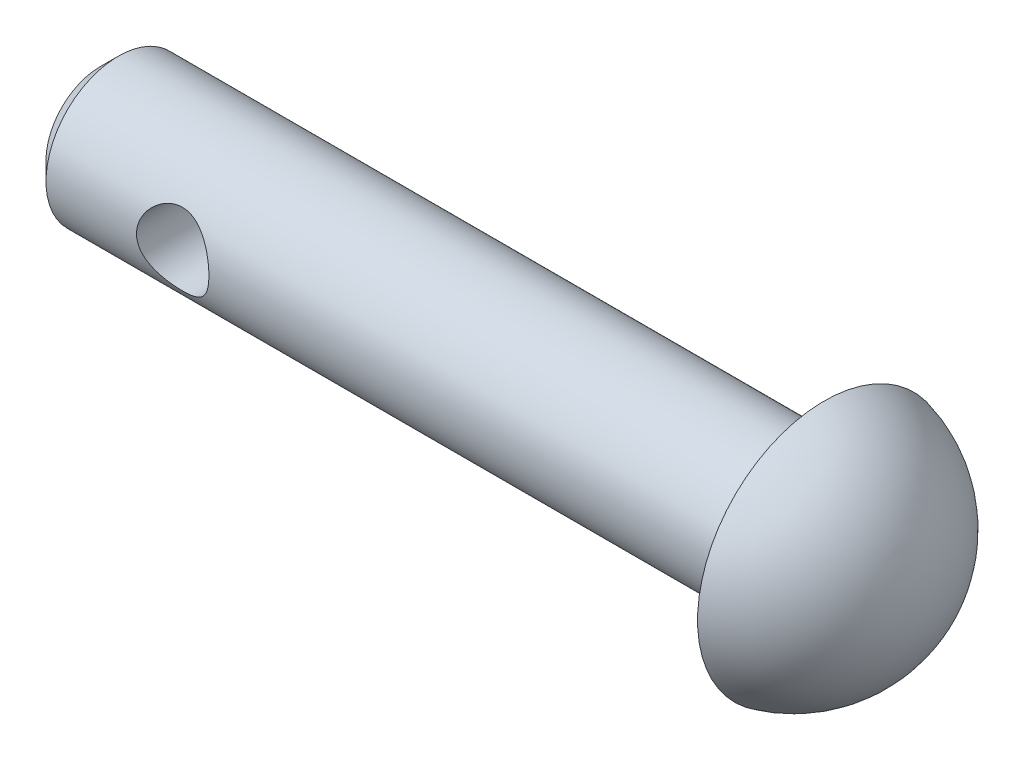
ISO-10303-21;
HEADER;
FILE_DESCRIPTION(('STEP AP214'),'2;1');
FILE_NAME('part.step','',(''),(''),'','','');
FILE_SCHEMA(('AUTOMOTIVE_DESIGN { 1 0 10303 214 1 1 1 1 }'));
ENDSEC;
DATA;
#1=APPLICATION_CONTEXT('core data for automotive mechanical design processes');
#2=APPLICATION_PROTOCOL_DEFINITION('international standard','automotive_design',2000,#1);
#3=PRODUCT_CONTEXT('',#1,'mechanical');
#4=PRODUCT('Part','Part','',(#3));
#5=PRODUCT_RELATED_PRODUCT_CATEGORY('part','',(#4));
#6=PRODUCT_DEFINITION_FORMATION('','',#4);
#7=PRODUCT_DEFINITION_CONTEXT('part definition',#1,'design');
#8=PRODUCT_DEFINITION('design','',#6,#7);
#9=PRODUCT_DEFINITION_SHAPE('','',#8);
#10=(LENGTH_UNIT() NAMED_UNIT(*) SI_UNIT(.MILLI.,.METRE.));
#11=(NAMED_UNIT(*) PLANE_ANGLE_UNIT() SI_UNIT($,.RADIAN.));
#12=(NAMED_UNIT(*) SI_UNIT($,.STERADIAN.) SOLID_ANGLE_UNIT());
#13=UNCERTAINTY_MEASURE_WITH_UNIT(LENGTH_MEASURE(1.E-05),#10,'distance_accuracy_value','');
#14=(GEOMETRIC_REPRESENTATION_CONTEXT(3) GLOBAL_UNCERTAINTY_ASSIGNED_CONTEXT((#13)) GLOBAL_UNIT_ASSIGNED_CONTEXT((#10,
#11,#12)) REPRESENTATION_CONTEXT('',''));
#15=CARTESIAN_POINT('',(0.,0.,0.));
#16=DIRECTION('',(0.,0.,1.));
#17=DIRECTION('',(1.,0.,0.));
#18=AXIS2_PLACEMENT_3D('',#15,#16,#17);
#19=CARTESIAN_POINT('',(-20.,0.,0.));
#20=DIRECTION('',(1.,0.,0.));
#21=DIRECTION('',(0.,0.,-1.));
#22=AXIS2_PLACEMENT_3D('',#19,#20,#21);
#23=CYLINDRICAL_SURFACE('',#22,2.);
#24=CARTESIAN_POINT('',(-19.5,0.,0.));
#25=DIRECTION('',(1.,0.,0.));
#26=DIRECTION('',(0.,0.,-1.));
#27=AXIS2_PLACEMENT_3D('',#24,#25,#26);
#28=CIRCLE('',#27,2.);
#29=CARTESIAN_POINT('',(-19.5,0.,-2.));
#30=VERTEX_POINT('',#29);
#31=EDGE_CURVE('E41',#30,#30,#28,.T.);
#32=ORIENTED_EDGE('',*,*,#31,.T.);
#33=EDGE_LOOP('',(#32));
#34=FACE_BOUND('',#33,.T.);
#35=CARTESIAN_POINT('',(-15.,0.,-2.));
#36=CARTESIAN_POINT('',(-15.0000033023195,-0.0525719629529865,-1.99999713404151));
#37=CARTESIAN_POINT('',(-15.0041700731217,-0.105206599698033,-1.99790491019518));
#38=CARTESIAN_POINT('',(-15.0206528803409,-0.208920235268425,-1.98974156037396));
#39=CARTESIAN_POINT('',(-15.0329843929976,-0.259996086713504,-1.98366287828984));
#40=CARTESIAN_POINT('',(-15.0651938086168,-0.358933544880575,-1.96816279403312));
#41=CARTESIAN_POINT('',(-15.085042384248,-0.406806802939181,-1.9587543917752));
#42=CARTESIAN_POINT('',(-15.1315706213649,-0.498472616806566,-1.93745776515779));
#43=CARTESIAN_POINT('',(-15.1582497442489,-0.54226549399005,-1.9255697363353));
#44=CARTESIAN_POINT('',(-15.2195172494853,-0.62750781776192,-1.89956258258057));
#45=CARTESIAN_POINT('',(-15.2544864792396,-0.668655211122113,-1.88535199127536));
#46=CARTESIAN_POINT('',(-15.330521479247,-0.744779444866978,-1.85659970246744));
#47=CARTESIAN_POINT('',(-15.3715918517724,-0.779751583106767,-1.84205776209035));
#48=CARTESIAN_POINT('',(-15.4624833495234,-0.84525200045028,-1.81298951197347));
#49=CARTESIAN_POINT('',(-15.5127360983459,-0.875225335551638,-1.79855186970132));
#50=CARTESIAN_POINT('',(-15.6183673359862,-0.926168226890696,-1.77285978772321));
#51=CARTESIAN_POINT('',(-15.6737421287227,-0.947144214966335,-1.7616030760699));
#52=CARTESIAN_POINT('',(-15.7846651054219,-0.97813244218859,-1.74457867037808));
#53=CARTESIAN_POINT('',(-15.8400044520674,-0.988725857080443,-1.73852271583713));
#54=CARTESIAN_POINT('',(-15.9519788377795,-1.00042699330885,-1.73181889948528));
#55=CARTESIAN_POINT('',(-16.0086125408712,-1.00154408837308,-1.73116569343288));
#56=CARTESIAN_POINT('',(-16.1142860243154,-0.994687287172296,-1.73510930257248));
#57=CARTESIAN_POINT('',(-16.163424031223,-0.987784559536823,-1.73908763662013));
#58=CARTESIAN_POINT('',(-16.259721909373,-0.966939849056935,-1.7507622873385));
#59=CARTESIAN_POINT('',(-16.3068811453053,-0.952995623897654,-1.75845978831776));
#60=CARTESIAN_POINT('',(-16.3992291325657,-0.918209780386006,-1.77687476412741));
#61=CARTESIAN_POINT('',(-16.4443463987858,-0.897215067115997,-1.78765840663998));
#62=CARTESIAN_POINT('',(-16.53063429259,-0.849041687668004,-1.81103404281404));
#63=CARTESIAN_POINT('',(-16.5718031356001,-0.821860243812469,-1.8236268478019));
#64=CARTESIAN_POINT('',(-16.6545212527432,-0.75806605491279,-1.85113157903286));
#65=CARTESIAN_POINT('',(-16.6954568735762,-0.720694458369283,-1.86613510236746));
#66=CARTESIAN_POINT('',(-16.7707354185909,-0.639555578741374,-1.89547623300407));
#67=CARTESIAN_POINT('',(-16.8050751920339,-0.595785256574287,-1.90981351958801));
#68=CARTESIAN_POINT('',(-16.8676856610297,-0.50051650583185,-1.93701987282964));
#69=CARTESIAN_POINT('',(-16.8956004724457,-0.448753591599411,-1.94978984162007));
#70=CARTESIAN_POINT('',(-16.942097029043,-0.340466215488799,-1.97157881121242));
#71=CARTESIAN_POINT('',(-16.9606861850152,-0.283945576265279,-1.98060078943553));
#72=CARTESIAN_POINT('',(-16.9864754037167,-0.172766491660705,-1.99324333741436));
#73=CARTESIAN_POINT('',(-16.9944912357468,-0.118341530548327,-1.99724938301312));
#74=CARTESIAN_POINT('',(-17.0014647311345,-0.00877959994935651,-2.00073013459102));
#75=CARTESIAN_POINT('',(-17.0004266856395,0.0463570198698988,-2.00020698721312));
#76=CARTESIAN_POINT('',(-16.9897933115812,0.151232971985991,-1.99491192253441));
#77=CARTESIAN_POINT('',(-16.98086746727,0.201059408049952,-1.9904724568819));
#78=CARTESIAN_POINT('',(-16.9557619281049,0.298406892301915,-1.97822171314819));
#79=CARTESIAN_POINT('',(-16.9395814335466,0.345927685690995,-1.97041006334332));
#80=CARTESIAN_POINT('',(-16.9000015335668,0.438888608449664,-1.95184251413669));
#81=CARTESIAN_POINT('',(-16.8764089498832,0.484230397006153,-1.94100881769939));
#82=CARTESIAN_POINT('',(-16.822892464354,0.570461361698921,-1.91743974317109));
#83=CARTESIAN_POINT('',(-16.7929658654066,0.611348629775281,-1.90470355565785));
#84=CARTESIAN_POINT('',(-16.7242395746671,0.691767689290653,-1.87708221337464));
#85=CARTESIAN_POINT('',(-16.6848571315464,0.730772077824639,-1.86210884848441));
#86=CARTESIAN_POINT('',(-16.6000748487307,0.80185632111324,-1.83262391603874));
#87=CARTESIAN_POINT('',(-16.5546708811836,0.833931385690841,-1.81811267381526));
#88=CARTESIAN_POINT('',(-16.4563563457997,0.891707914497694,-1.79051192226068));
#89=CARTESIAN_POINT('',(-16.4031887337914,0.917025495878636,-1.77752529663472));
#90=CARTESIAN_POINT('',(-16.2924899323075,0.958082826013803,-1.75574072368126));
#91=CARTESIAN_POINT('',(-16.2349644734988,0.97383491588757,-1.74693738240618));
#92=CARTESIAN_POINT('',(-16.1230897771386,0.99386168744968,-1.73561501008667));
#93=CARTESIAN_POINT('',(-16.068965746571,0.999092996400866,-1.73257383460491));
#94=CARTESIAN_POINT('',(-15.9605529328293,1.00068915438079,-1.73165354646175));
#95=CARTESIAN_POINT('',(-15.9062642312606,0.997057846624401,-1.73377219627552));
#96=CARTESIAN_POINT('',(-15.804516498468,0.981926125592265,-1.74237862050025));
#97=CARTESIAN_POINT('',(-15.7568995298556,0.971208314342801,-1.74843094482394));
#98=CARTESIAN_POINT('',(-15.6641918805753,0.943175358224647,-1.76371016187917));
#99=CARTESIAN_POINT('',(-15.619102017908,0.925858091159812,-1.77293807569675));
#100=CARTESIAN_POINT('',(-15.5293751490134,0.883815745300685,-1.79428530364528));
#101=CARTESIAN_POINT('',(-15.4849720981703,0.85867113781646,-1.8065572239619));
#102=CARTESIAN_POINT('',(-15.4007254638194,0.802150971636636,-1.8323533163459));
#103=CARTESIAN_POINT('',(-15.3608842694815,0.77077217123865,-1.84587813794522));
#104=CARTESIAN_POINT('',(-15.2818580176424,0.698203326664643,-1.87462323159313));
#105=CARTESIAN_POINT('',(-15.2433408976381,0.656284423010173,-1.88984983311469));
#106=CARTESIAN_POINT('',(-15.1737370165764,0.566154806220281,-1.91877752255088));
#107=CARTESIAN_POINT('',(-15.1426542605737,0.517940723256786,-1.9324777860804));
#108=CARTESIAN_POINT('',(-15.0887636372378,0.415931596819949,-1.95698009585103));
#109=CARTESIAN_POINT('',(-15.0660158305886,0.362099503934616,-1.96776096562909));
#110=CARTESIAN_POINT('',(-15.030191832081,0.250742101294193,-1.98501341363465));
#111=CARTESIAN_POINT('',(-15.0170881531704,0.193227799623168,-1.99149723372932));
#112=CARTESIAN_POINT('',(-15.0061025889241,0.112601946483386,-1.99695461909663));
#113=CARTESIAN_POINT('',(-15.0038173591364,0.0901618794395003,-1.99809365339202));
#114=CARTESIAN_POINT('',(-15.0007653344832,0.0451517318071585,-1.99961696977865));
#115=CARTESIAN_POINT('',(-14.9999985815288,0.0225816476473818,-2.00000123103763));
#116=CARTESIAN_POINT('',(-15.,0.,-2.));
#117=B_SPLINE_CURVE_WITH_KNOTS('',3,(#35,#36,#37,#38,#39,#40,#41,#42,#43,#44,#45,#46,#47,#48,
#49,#50,#51,#52,#53,#54,#55,#56,#57,#58,#59,#60,#61,#62,#63,#64,#65,#66,#67,#68,#69,#70,#71,#72,
#73,#74,#75,#76,#77,#78,#79,#80,#81,#82,#83,#84,#85,#86,#87,#88,#89,#90,#91,#92,#93,#94,#95,#96,
#97,#98,#99,#100,#101,#102,#103,#104,#105,#106,#107,#108,#109,#110,#111,#112,#113,#114,#115,
#116),.UNSPECIFIED.,.T.,.F.,(4,2,2,2,2,2,2,2,2,2,2,2,2,2,2,2,2,2,2,2,2,2,2,2,2,2,2,2,2,2,2,2,2,
2,2,2,2,2,2,2,4),(0.,0.157624257420293,0.315548149709198,0.472862155492299,0.630163760581568,
0.79698175871809,0.963926237654036,1.14381726430753,1.32357947898281,1.4925801214023,
1.6614135732902,1.8100571240932,1.95874803925678,2.11090240168487,2.26312521260222,
2.43464941333879,2.60625534598687,2.78583022214441,2.9652621691228,3.12983290471346,
3.29432564511476,3.44606906506122,3.59782921630932,3.75392856027899,3.9100945074834,
4.08159610644419,4.25321588615432,4.43314682159674,4.61284511940778,4.77529307498374,
4.93767059860006,5.08457930244183,5.23153528783678,5.38836456775615,5.54527561138958,
5.72125242752499,5.89732383376573,6.07464013662926,6.25144908624931,6.31915280137698,
6.38685838514848),.UNSPECIFIED.);
#118=CARTESIAN_POINT('',(-15.,0.,-2.));
#119=VERTEX_POINT('',#118);
#120=EDGE_CURVE('E45',#119,#119,#117,.T.);
#121=ORIENTED_EDGE('',*,*,#120,.F.);
#122=EDGE_LOOP('',(#121));
#123=FACE_BOUND('',#122,.T.);
#124=CARTESIAN_POINT('',(-15.,0.,2.));
#125=CARTESIAN_POINT('',(-15.0000033023195,0.0525719629529865,1.99999713404151));
#126=CARTESIAN_POINT('',(-15.0041700731217,0.105206599698033,1.99790491019518));
#127=CARTESIAN_POINT('',(-15.0206528803409,0.208920235268425,1.98974156037396));
#128=CARTESIAN_POINT('',(-15.0329843929976,0.259996086713504,1.98366287828984));
#129=CARTESIAN_POINT('',(-15.0651938086168,0.358933544880575,1.96816279403312));
#130=CARTESIAN_POINT('',(-15.085042384248,0.406806802939181,1.9587543917752));
#131=CARTESIAN_POINT('',(-15.1315706213649,0.498472616806566,1.93745776515779));
#132=CARTESIAN_POINT('',(-15.1582497442489,0.54226549399005,1.9255697363353));
#133=CARTESIAN_POINT('',(-15.2195172494853,0.62750781776192,1.89956258258057));
#134=CARTESIAN_POINT('',(-15.2544864792396,0.668655211122113,1.88535199127536));
#135=CARTESIAN_POINT('',(-15.330521479247,0.744779444866978,1.85659970246744));
#136=CARTESIAN_POINT('',(-15.3715918517724,0.779751583106767,1.84205776209035));
#137=CARTESIAN_POINT('',(-15.4624833495234,0.84525200045028,1.81298951197347));
#138=CARTESIAN_POINT('',(-15.5127360983459,0.875225335551638,1.79855186970132));
#139=CARTESIAN_POINT('',(-15.6183673359862,0.926168226890696,1.77285978772321));
#140=CARTESIAN_POINT('',(-15.6737421287227,0.947144214966335,1.7616030760699));
#141=CARTESIAN_POINT('',(-15.7846651054219,0.97813244218859,1.74457867037808));
#142=CARTESIAN_POINT('',(-15.8400044520674,0.988725857080443,1.73852271583713));
#143=CARTESIAN_POINT('',(-15.9519788377795,1.00042699330885,1.73181889948528));
#144=CARTESIAN_POINT('',(-16.0086125408712,1.00154408837308,1.73116569343288));
#145=CARTESIAN_POINT('',(-16.1142860243154,0.994687287172296,1.73510930257248));
#146=CARTESIAN_POINT('',(-16.163424031223,0.987784559536823,1.73908763662013));
#147=CARTESIAN_POINT('',(-16.259721909373,0.966939849056935,1.7507622873385));
#148=CARTESIAN_POINT('',(-16.3068811453053,0.952995623897654,1.75845978831776));
#149=CARTESIAN_POINT('',(-16.3992291325657,0.918209780386006,1.77687476412741));
#150=CARTESIAN_POINT('',(-16.4443463987858,0.897215067115997,1.78765840663998));
#151=CARTESIAN_POINT('',(-16.53063429259,0.849041687668004,1.81103404281404));
#152=CARTESIAN_POINT('',(-16.5718031356001,0.821860243812469,1.8236268478019));
#153=CARTESIAN_POINT('',(-16.6545212527432,0.75806605491279,1.85113157903286));
#154=CARTESIAN_POINT('',(-16.6954568735762,0.720694458369283,1.86613510236746));
#155=CARTESIAN_POINT('',(-16.7707354185909,0.639555578741374,1.89547623300407));
#156=CARTESIAN_POINT('',(-16.8050751920339,0.595785256574287,1.90981351958801));
#157=CARTESIAN_POINT('',(-16.8676856610297,0.50051650583185,1.93701987282964));
#158=CARTESIAN_POINT('',(-16.8956004724457,0.448753591599411,1.94978984162007));
#159=CARTESIAN_POINT('',(-16.942097029043,0.340466215488799,1.97157881121242));
#160=CARTESIAN_POINT('',(-16.9606861850152,0.283945576265279,1.98060078943553));
#161=CARTESIAN_POINT('',(-16.9864754037167,0.172766491660705,1.99324333741436));
#162=CARTESIAN_POINT('',(-16.9944912357468,0.118341530548327,1.99724938301312));
#163=CARTESIAN_POINT('',(-17.0014647311345,0.00877959994935651,2.00073013459102));
#164=CARTESIAN_POINT('',(-17.0004266856395,-0.0463570198698988,2.00020698721312));
#165=CARTESIAN_POINT('',(-16.9897933115812,-0.151232971985991,1.99491192253441));
#166=CARTESIAN_POINT('',(-16.98086746727,-0.201059408049952,1.9904724568819));
#167=CARTESIAN_POINT('',(-16.9557619281049,-0.298406892301915,1.97822171314819));
#168=CARTESIAN_POINT('',(-16.9395814335466,-0.345927685690995,1.97041006334332));
#169=CARTESIAN_POINT('',(-16.9000015335668,-0.438888608449664,1.95184251413669));
#170=CARTESIAN_POINT('',(-16.8764089498832,-0.484230397006153,1.94100881769939));
#171=CARTESIAN_POINT('',(-16.822892464354,-0.570461361698921,1.91743974317109));
#172=CARTESIAN_POINT('',(-16.7929658654066,-0.611348629775281,1.90470355565785));
#173=CARTESIAN_POINT('',(-16.7242395746671,-0.691767689290653,1.87708221337464));
#174=CARTESIAN_POINT('',(-16.6848571315464,-0.730772077824639,1.86210884848441));
#175=CARTESIAN_POINT('',(-16.6000748487307,-0.80185632111324,1.83262391603874));
#176=CARTESIAN_POINT('',(-16.5546708811836,-0.833931385690841,1.81811267381526));
#177=CARTESIAN_POINT('',(-16.4563563457997,-0.891707914497694,1.79051192226068));
#178=CARTESIAN_POINT('',(-16.4031887337914,-0.917025495878636,1.77752529663472));
#179=CARTESIAN_POINT('',(-16.2924899323075,-0.958082826013803,1.75574072368126));
#180=CARTESIAN_POINT('',(-16.2349644734988,-0.97383491588757,1.74693738240618));
#181=CARTESIAN_POINT('',(-16.1230897771386,-0.99386168744968,1.73561501008667));
#182=CARTESIAN_POINT('',(-16.068965746571,-0.999092996400866,1.73257383460491));
#183=CARTESIAN_POINT('',(-15.9605529328293,-1.00068915438079,1.73165354646175));
#184=CARTESIAN_POINT('',(-15.9062642312606,-0.997057846624401,1.73377219627552));
#185=CARTESIAN_POINT('',(-15.804516498468,-0.981926125592265,1.74237862050025));
#186=CARTESIAN_POINT('',(-15.7568995298556,-0.971208314342801,1.74843094482394));
#187=CARTESIAN_POINT('',(-15.6641918805753,-0.943175358224647,1.76371016187917));
#188=CARTESIAN_POINT('',(-15.619102017908,-0.925858091159812,1.77293807569675));
#189=CARTESIAN_POINT('',(-15.5293751490134,-0.883815745300685,1.79428530364528));
#190=CARTESIAN_POINT('',(-15.4849720981703,-0.85867113781646,1.8065572239619));
#191=CARTESIAN_POINT('',(-15.4007254638194,-0.802150971636636,1.8323533163459));
#192=CARTESIAN_POINT('',(-15.3608842694815,-0.77077217123865,1.84587813794522));
#193=CARTESIAN_POINT('',(-15.2818580176424,-0.698203326664643,1.87462323159313));
#194=CARTESIAN_POINT('',(-15.2433408976381,-0.656284423010173,1.88984983311469));
#195=CARTESIAN_POINT('',(-15.1737370165764,-0.566154806220281,1.91877752255088));
#196=CARTESIAN_POINT('',(-15.1426542605737,-0.517940723256786,1.9324777860804));
#197=CARTESIAN_POINT('',(-15.0887636372378,-0.415931596819949,1.95698009585103));
#198=CARTESIAN_POINT('',(-15.0660158305886,-0.362099503934616,1.96776096562909));
#199=CARTESIAN_POINT('',(-15.030191832081,-0.250742101294193,1.98501341363465));
#200=CARTESIAN_POINT('',(-15.0170881531704,-0.193227799623168,1.99149723372932));
#201=CARTESIAN_POINT('',(-15.0061025889241,-0.112601946483386,1.99695461909663));
#202=CARTESIAN_POINT('',(-15.0038173591364,-0.0901618794395003,1.99809365339202));
#203=CARTESIAN_POINT('',(-15.0007653344832,-0.0451517318071585,1.99961696977865));
#204=CARTESIAN_POINT('',(-14.9999985815288,-0.0225816476473818,2.00000123103763));
#205=CARTESIAN_POINT('',(-15.,0.,2.));
#206=B_SPLINE_CURVE_WITH_KNOTS('',3,(#124,#125,#126,#127,#128,#129,#130,#131,#132,#133,#134,
#135,#136,#137,#138,#139,#140,#141,#142,#143,#144,#145,#146,#147,#148,#149,#150,#151,#152,#153,
#154,#155,#156,#157,#158,#159,#160,#161,#162,#163,#164,#165,#166,#167,#168,#169,#170,#171,#172,
#173,#174,#175,#176,#177,#178,#179,#180,#181,#182,#183,#184,#185,#186,#187,#188,#189,#190,#191,
#192,#193,#194,#195,#196,#197,#198,#199,#200,#201,#202,#203,#204,#205),.UNSPECIFIED.,.T.,.F.,(4,
2,2,2,2,2,2,2,2,2,2,2,2,2,2,2,2,2,2,2,2,2,2,2,2,2,2,2,2,2,2,2,2,2,2,2,2,2,2,2,4),(0.,
0.157624257420293,0.315548149709198,0.472862155492299,0.630163760581568,0.79698175871809,
0.963926237654036,1.14381726430753,1.32357947898281,1.4925801214023,1.6614135732902,
1.8100571240932,1.95874803925678,2.11090240168487,2.26312521260222,2.43464941333879,
2.60625534598687,2.78583022214441,2.9652621691228,3.12983290471346,3.29432564511476,
3.44606906506122,3.59782921630932,3.75392856027899,3.9100945074834,4.08159610644419,
4.25321588615432,4.43314682159674,4.61284511940778,4.77529307498374,4.93767059860006,
5.08457930244183,5.23153528783678,5.38836456775615,5.54527561138958,5.72125242752499,
5.89732383376573,6.07464013662926,6.25144908624931,6.31915280137698,6.38685838514848),.UNSPECIFIED.);
#207=CARTESIAN_POINT('',(-15.,0.,2.));
#208=VERTEX_POINT('',#207);
#209=EDGE_CURVE('E49',#208,#208,#206,.T.);
#210=ORIENTED_EDGE('',*,*,#209,.F.);
#211=EDGE_LOOP('',(#210));
#212=FACE_BOUND('',#211,.T.);
#213=CARTESIAN_POINT('',(0.,0.,0.));
#214=DIRECTION('',(1.,0.,0.));
#215=DIRECTION('',(0.,0.,-1.));
#216=AXIS2_PLACEMENT_3D('',#213,#214,#215);
#217=CIRCLE('',#216,2.);
#218=CARTESIAN_POINT('',(0.,0.,-2.));
#219=VERTEX_POINT('',#218);
#220=EDGE_CURVE('E85',#219,#219,#217,.T.);
#221=ORIENTED_EDGE('',*,*,#220,.F.);
#222=EDGE_LOOP('',(#221));
#223=FACE_BOUND('',#222,.T.);
#224=ADVANCED_FACE('F34',(#34,#123,#212,#223),#23,.T.);
#225=CARTESIAN_POINT('',(-20.,0.,0.));
#226=DIRECTION('',(1.,0.,0.));
#227=DIRECTION('',(0.,0.,-1.));
#228=AXIS2_PLACEMENT_3D('',#225,#226,#227);
#229=PLANE('',#228);
#230=CARTESIAN_POINT('',(-20.,0.,0.));
#231=DIRECTION('',(1.,0.,0.));
#232=DIRECTION('',(0.,0.,-1.));
#233=AXIS2_PLACEMENT_3D('',#230,#231,#232);
#234=CIRCLE('',#233,1.49999999999999);
#235=CARTESIAN_POINT('',(-20.,0.,-1.49999999999999));
#236=VERTEX_POINT('',#235);
#237=EDGE_CURVE('E10',#236,#236,#234,.F.);
#238=ORIENTED_EDGE('',*,*,#237,.T.);
#239=EDGE_LOOP('',(#238));
#240=FACE_BOUND('',#239,.T.);
#241=ADVANCED_FACE('F66',(#240),#229,.F.);
#242=CARTESIAN_POINT('',(-16.,0.,-2.));
#243=DIRECTION('',(0.,0.,1.));
#244=DIRECTION('',(1.,0.,0.));
#245=AXIS2_PLACEMENT_3D('',#242,#243,#244);
#246=CYLINDRICAL_SURFACE('',#245,1.);
#247=ORIENTED_EDGE('',*,*,#120,.T.);
#248=EDGE_LOOP('',(#247));
#249=FACE_BOUND('',#248,.T.);
#250=ORIENTED_EDGE('',*,*,#209,.T.);
#251=EDGE_LOOP('',(#250));
#252=FACE_BOUND('',#251,.T.);
#253=ADVANCED_FACE('F62',(#249,#252),#246,.F.);
#254=CARTESIAN_POINT('',(-19.5,0.,0.));
#255=DIRECTION('',(1.,0.,0.));
#256=DIRECTION('',(0.,0.,-1.));
#257=AXIS2_PLACEMENT_3D('',#254,#255,#256);
#258=CONICAL_SURFACE('',#257,2.,0.785398163397452);
#259=ORIENTED_EDGE('',*,*,#237,.F.);
#260=EDGE_LOOP('',(#259));
#261=FACE_BOUND('',#260,.T.);
#262=ORIENTED_EDGE('',*,*,#31,.F.);
#263=EDGE_LOOP('',(#262));
#264=FACE_BOUND('',#263,.T.);
#265=ADVANCED_FACE('F36',(#261,#264),#258,.T.);
#266=CARTESIAN_POINT('',(-0.842614977317633,0.,0.));
#267=DIRECTION('',(1.,0.,0.));
#268=DIRECTION('',(0.,0.,-1.));
#269=AXIS2_PLACEMENT_3D('',#266,#267,#268);
#270=SPHERICAL_SURFACE('',#269,3.6);
#271=CARTESIAN_POINT('',(0.,0.,0.));
#272=DIRECTION('',(1.,0.,0.));
#273=DIRECTION('',(0.,0.,-1.));
#274=AXIS2_PLACEMENT_3D('',#271,#272,#273);
#275=CIRCLE('',#274,3.5);
#276=CARTESIAN_POINT('',(0.,0.,-3.5));
#277=VERTEX_POINT('',#276);
#278=EDGE_CURVE('E87',#277,#277,#275,.T.);
#279=ORIENTED_EDGE('',*,*,#278,.T.);
#280=EDGE_LOOP('',(#279));
#281=FACE_BOUND('',#280,.T.);
#282=ADVANCED_FACE('F68',(#281),#270,.T.);
#283=CARTESIAN_POINT('',(0.,0.,0.));
#284=DIRECTION('',(-1.,0.,0.));
#285=DIRECTION('',(0.,0.,1.));
#286=AXIS2_PLACEMENT_3D('',#283,#284,#285);
#287=PLANE('',#286);
#288=ORIENTED_EDGE('',*,*,#220,.T.);
#289=EDGE_LOOP('',(#288));
#290=FACE_BOUND('',#289,.T.);
#291=ORIENTED_EDGE('',*,*,#278,.F.);
#292=EDGE_LOOP('',(#291));
#293=FACE_BOUND('',#292,.T.);
#294=ADVANCED_FACE('F93',(#290,#293),#287,.T.);
#295=CLOSED_SHELL('',(#224,#241,#253,#265,#282,#294));
#296=MANIFOLD_SOLID_BREP('B2',#295);
#297=ADVANCED_BREP_SHAPE_REPRESENTATION('',(#18,#296),#14);
#298=SHAPE_DEFINITION_REPRESENTATION(#9,#297);
ENDSEC;
END-ISO-10303-21;
